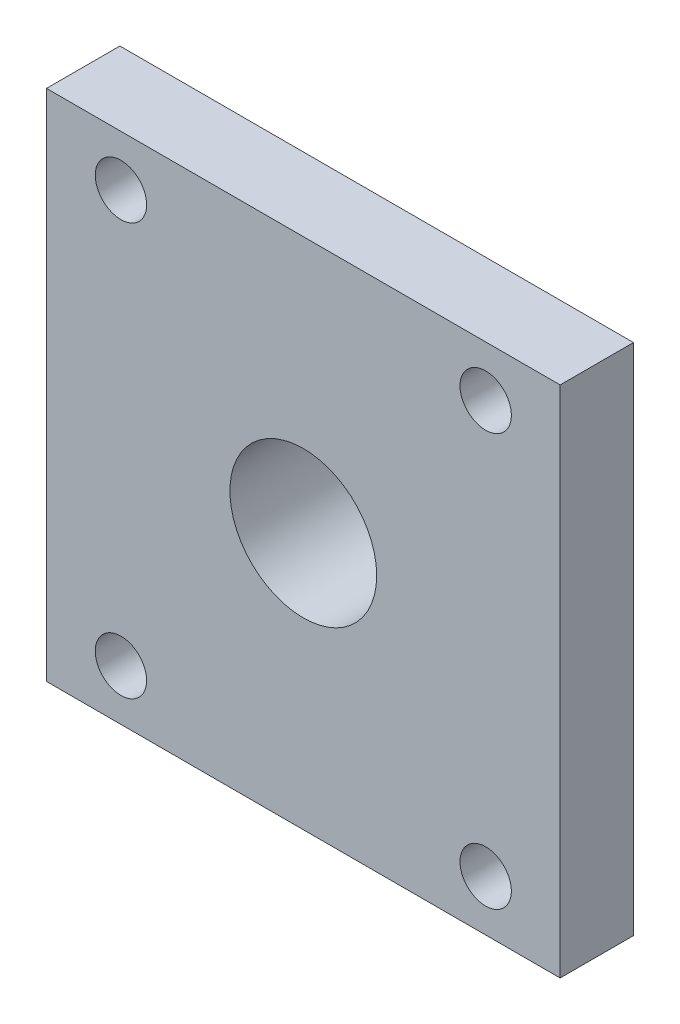
ISO-10303-21;
HEADER;
FILE_DESCRIPTION(('STEP AP214'),'2;1');
FILE_NAME('part.step','',(''),(''),'','','');
FILE_SCHEMA(('AUTOMOTIVE_DESIGN { 1 0 10303 214 1 1 1 1 }'));
ENDSEC;
DATA;
#1=APPLICATION_CONTEXT('core data for automotive mechanical design processes');
#2=APPLICATION_PROTOCOL_DEFINITION('international standard','automotive_design',2000,#1);
#3=PRODUCT_CONTEXT('',#1,'mechanical');
#4=PRODUCT('Part','Part','',(#3));
#5=PRODUCT_RELATED_PRODUCT_CATEGORY('part','',(#4));
#6=PRODUCT_DEFINITION_FORMATION('','',#4);
#7=PRODUCT_DEFINITION_CONTEXT('part definition',#1,'design');
#8=PRODUCT_DEFINITION('design','',#6,#7);
#9=PRODUCT_DEFINITION_SHAPE('','',#8);
#10=(LENGTH_UNIT() NAMED_UNIT(*) SI_UNIT(.MILLI.,.METRE.));
#11=(NAMED_UNIT(*) PLANE_ANGLE_UNIT() SI_UNIT($,.RADIAN.));
#12=(NAMED_UNIT(*) SI_UNIT($,.STERADIAN.) SOLID_ANGLE_UNIT());
#13=UNCERTAINTY_MEASURE_WITH_UNIT(LENGTH_MEASURE(1.E-05),#10,'distance_accuracy_value','');
#14=(GEOMETRIC_REPRESENTATION_CONTEXT(3) GLOBAL_UNCERTAINTY_ASSIGNED_CONTEXT((#13)) GLOBAL_UNIT_ASSIGNED_CONTEXT((#10,
#11,#12)) REPRESENTATION_CONTEXT('',''));
#15=CARTESIAN_POINT('',(0.,0.,0.));
#16=DIRECTION('',(0.,0.,1.));
#17=DIRECTION('',(1.,0.,0.));
#18=AXIS2_PLACEMENT_3D('',#15,#16,#17);
#19=CARTESIAN_POINT('',(0.,0.,0.));
#20=DIRECTION('',(0.,0.,1.));
#21=DIRECTION('',(1.,0.,0.));
#22=AXIS2_PLACEMENT_3D('',#19,#20,#21);
#23=PLANE('',#22);
#24=DIRECTION('',(0.,1.,0.));
#25=VECTOR('',#24,1.);
#26=CARTESIAN_POINT('',(35.,35.,0.));
#27=LINE('',#26,#25);
#28=CARTESIAN_POINT('',(35.,-35.,0.));
#29=VERTEX_POINT('',#28);
#30=CARTESIAN_POINT('',(35.,35.,0.));
#31=VERTEX_POINT('',#30);
#32=EDGE_CURVE('E100',#29,#31,#27,.T.);
#33=ORIENTED_EDGE('',*,*,#32,.F.);
#34=DIRECTION('',(1.,0.,0.));
#35=VECTOR('',#34,1.);
#36=CARTESIAN_POINT('',(-35.,-35.,0.));
#37=LINE('',#36,#35);
#38=CARTESIAN_POINT('',(-35.,-35.,0.));
#39=VERTEX_POINT('',#38);
#40=EDGE_CURVE('E73',#39,#29,#37,.T.);
#41=ORIENTED_EDGE('',*,*,#40,.F.);
#42=DIRECTION('',(0.,-1.,0.));
#43=VECTOR('',#42,1.);
#44=CARTESIAN_POINT('',(-35.,35.,0.));
#45=LINE('',#44,#43);
#46=CARTESIAN_POINT('',(-35.,35.,0.));
#47=VERTEX_POINT('',#46);
#48=EDGE_CURVE('E67',#47,#39,#45,.T.);
#49=ORIENTED_EDGE('',*,*,#48,.F.);
#50=DIRECTION('',(-1.,0.,0.));
#51=VECTOR('',#50,1.);
#52=CARTESIAN_POINT('',(-35.,35.,0.));
#53=LINE('',#52,#51);
#54=EDGE_CURVE('E91',#31,#47,#53,.T.);
#55=ORIENTED_EDGE('',*,*,#54,.F.);
#56=EDGE_LOOP('',(#33,#41,#49,#55));
#57=FACE_BOUND('',#56,.T.);
#58=CARTESIAN_POINT('',(24.8555920853749,28.0793436904328,0.));
#59=DIRECTION('',(0.,0.,-1.));
#60=DIRECTION('',(-1.,0.,0.));
#61=AXIS2_PLACEMENT_3D('',#58,#59,#60);
#62=CIRCLE('',#61,3.5);
#63=CARTESIAN_POINT('',(21.3555920853749,28.0793436904328,0.));
#64=VERTEX_POINT('',#63);
#65=EDGE_CURVE('E117',#64,#64,#62,.T.);
#66=ORIENTED_EDGE('',*,*,#65,.F.);
#67=EDGE_LOOP('',(#66));
#68=FACE_BOUND('',#67,.T.);
#69=CARTESIAN_POINT('',(-24.8555920853749,28.0793436904328,0.));
#70=DIRECTION('',(0.,0.,-1.));
#71=DIRECTION('',(-1.,0.,0.));
#72=AXIS2_PLACEMENT_3D('',#69,#70,#71);
#73=CIRCLE('',#72,3.5);
#74=CARTESIAN_POINT('',(-28.3555920853749,28.0793436904328,0.));
#75=VERTEX_POINT('',#74);
#76=EDGE_CURVE('E121',#75,#75,#73,.T.);
#77=ORIENTED_EDGE('',*,*,#76,.F.);
#78=EDGE_LOOP('',(#77));
#79=FACE_BOUND('',#78,.T.);
#80=CARTESIAN_POINT('',(-24.8555920853749,-28.0793436904328,0.));
#81=DIRECTION('',(0.,0.,-1.));
#82=DIRECTION('',(-1.,0.,0.));
#83=AXIS2_PLACEMENT_3D('',#80,#81,#82);
#84=CIRCLE('',#83,3.5);
#85=CARTESIAN_POINT('',(-28.3555920853749,-28.0793436904328,0.));
#86=VERTEX_POINT('',#85);
#87=EDGE_CURVE('E125',#86,#86,#84,.T.);
#88=ORIENTED_EDGE('',*,*,#87,.F.);
#89=EDGE_LOOP('',(#88));
#90=FACE_BOUND('',#89,.T.);
#91=CARTESIAN_POINT('',(24.8555920853749,-28.0793436904328,0.));
#92=DIRECTION('',(0.,0.,-1.));
#93=DIRECTION('',(-1.,0.,0.));
#94=AXIS2_PLACEMENT_3D('',#91,#92,#93);
#95=CIRCLE('',#94,3.5);
#96=CARTESIAN_POINT('',(21.3555920853749,-28.0793436904328,0.));
#97=VERTEX_POINT('',#96);
#98=EDGE_CURVE('E129',#97,#97,#95,.T.);
#99=ORIENTED_EDGE('',*,*,#98,.F.);
#100=EDGE_LOOP('',(#99));
#101=FACE_BOUND('',#100,.T.);
#102=CARTESIAN_POINT('',(0.,0.,0.));
#103=DIRECTION('',(0.,0.,1.));
#104=DIRECTION('',(1.,0.,0.));
#105=AXIS2_PLACEMENT_3D('',#102,#103,#104);
#106=CIRCLE('',#105,13.0719617858748);
#107=CARTESIAN_POINT('',(13.0719617858748,0.,0.));
#108=VERTEX_POINT('',#107);
#109=EDGE_CURVE('E11',#108,#108,#106,.F.);
#110=ORIENTED_EDGE('',*,*,#109,.F.);
#111=EDGE_LOOP('',(#110));
#112=FACE_BOUND('',#111,.T.);
#113=ADVANCED_FACE('F33',(#57,#68,#79,#90,#101,#112),#23,.F.);
#114=CARTESIAN_POINT('',(35.,35.,10.));
#115=DIRECTION('',(-1.,0.,0.));
#116=DIRECTION('',(0.,-1.,0.));
#117=AXIS2_PLACEMENT_3D('',#114,#115,#116);
#118=PLANE('',#117);
#119=ORIENTED_EDGE('',*,*,#32,.T.);
#120=DIRECTION('',(0.,0.,-1.));
#121=VECTOR('',#120,1.);
#122=CARTESIAN_POINT('',(35.,35.,10.));
#123=LINE('',#122,#121);
#124=CARTESIAN_POINT('',(35.,35.,10.));
#125=VERTEX_POINT('',#124);
#126=EDGE_CURVE('E42',#125,#31,#123,.T.);
#127=ORIENTED_EDGE('',*,*,#126,.F.);
#128=DIRECTION('',(0.,1.,0.));
#129=VECTOR('',#128,1.);
#130=CARTESIAN_POINT('',(35.,35.,10.));
#131=LINE('',#130,#129);
#132=CARTESIAN_POINT('',(35.,-35.,10.));
#133=VERTEX_POINT('',#132);
#134=EDGE_CURVE('E86',#133,#125,#131,.T.);
#135=ORIENTED_EDGE('',*,*,#134,.F.);
#136=DIRECTION('',(0.,0.,-1.));
#137=VECTOR('',#136,1.);
#138=CARTESIAN_POINT('',(35.,-35.,10.));
#139=LINE('',#138,#137);
#140=EDGE_CURVE('E96',#133,#29,#139,.T.);
#141=ORIENTED_EDGE('',*,*,#140,.T.);
#142=EDGE_LOOP('',(#119,#127,#135,#141));
#143=FACE_BOUND('',#142,.T.);
#144=ADVANCED_FACE('F35',(#143),#118,.F.);
#145=CARTESIAN_POINT('',(-35.,35.,10.));
#146=DIRECTION('',(0.,-1.,0.));
#147=DIRECTION('',(0.,0.,-1.));
#148=AXIS2_PLACEMENT_3D('',#145,#146,#147);
#149=PLANE('',#148);
#150=ORIENTED_EDGE('',*,*,#54,.T.);
#151=DIRECTION('',(0.,0.,-1.));
#152=VECTOR('',#151,1.);
#153=CARTESIAN_POINT('',(-35.,35.,10.));
#154=LINE('',#153,#152);
#155=CARTESIAN_POINT('',(-35.,35.,10.));
#156=VERTEX_POINT('',#155);
#157=EDGE_CURVE('E89',#156,#47,#154,.T.);
#158=ORIENTED_EDGE('',*,*,#157,.F.);
#159=DIRECTION('',(-1.,0.,0.));
#160=VECTOR('',#159,1.);
#161=CARTESIAN_POINT('',(-35.,35.,10.));
#162=LINE('',#161,#160);
#163=EDGE_CURVE('E81',#125,#156,#162,.T.);
#164=ORIENTED_EDGE('',*,*,#163,.F.);
#165=ORIENTED_EDGE('',*,*,#126,.T.);
#166=EDGE_LOOP('',(#150,#158,#164,#165));
#167=FACE_BOUND('',#166,.T.);
#168=ADVANCED_FACE('F90',(#167),#149,.F.);
#169=CARTESIAN_POINT('',(-35.,35.,10.));
#170=DIRECTION('',(1.,0.,0.));
#171=DIRECTION('',(0.,0.,-1.));
#172=AXIS2_PLACEMENT_3D('',#169,#170,#171);
#173=PLANE('',#172);
#174=ORIENTED_EDGE('',*,*,#48,.T.);
#175=DIRECTION('',(0.,0.,-1.));
#176=VECTOR('',#175,1.);
#177=CARTESIAN_POINT('',(-35.,-35.,10.));
#178=LINE('',#177,#176);
#179=CARTESIAN_POINT('',(-35.,-35.,10.));
#180=VERTEX_POINT('',#179);
#181=EDGE_CURVE('E92',#180,#39,#178,.T.);
#182=ORIENTED_EDGE('',*,*,#181,.F.);
#183=DIRECTION('',(0.,-1.,0.));
#184=VECTOR('',#183,1.);
#185=CARTESIAN_POINT('',(-35.,35.,10.));
#186=LINE('',#185,#184);
#187=EDGE_CURVE('E84',#156,#180,#186,.T.);
#188=ORIENTED_EDGE('',*,*,#187,.F.);
#189=ORIENTED_EDGE('',*,*,#157,.T.);
#190=EDGE_LOOP('',(#174,#182,#188,#189));
#191=FACE_BOUND('',#190,.T.);
#192=ADVANCED_FACE('F94',(#191),#173,.F.);
#193=CARTESIAN_POINT('',(-35.,-35.,10.));
#194=DIRECTION('',(0.,1.,0.));
#195=DIRECTION('',(0.,0.,1.));
#196=AXIS2_PLACEMENT_3D('',#193,#194,#195);
#197=PLANE('',#196);
#198=ORIENTED_EDGE('',*,*,#40,.T.);
#199=ORIENTED_EDGE('',*,*,#140,.F.);
#200=DIRECTION('',(1.,0.,0.));
#201=VECTOR('',#200,1.);
#202=CARTESIAN_POINT('',(-35.,-35.,10.));
#203=LINE('',#202,#201);
#204=EDGE_CURVE('E50',#180,#133,#203,.T.);
#205=ORIENTED_EDGE('',*,*,#204,.F.);
#206=ORIENTED_EDGE('',*,*,#181,.T.);
#207=EDGE_LOOP('',(#198,#199,#205,#206));
#208=FACE_BOUND('',#207,.T.);
#209=ADVANCED_FACE('F165',(#208),#197,.F.);
#210=CARTESIAN_POINT('',(0.,0.,10.));
#211=DIRECTION('',(0.,0.,1.));
#212=DIRECTION('',(1.,0.,0.));
#213=AXIS2_PLACEMENT_3D('',#210,#211,#212);
#214=PLANE('',#213);
#215=CARTESIAN_POINT('',(24.8555920853749,-28.0793436904328,10.));
#216=DIRECTION('',(0.,0.,1.));
#217=DIRECTION('',(1.,0.,0.));
#218=AXIS2_PLACEMENT_3D('',#215,#216,#217);
#219=CIRCLE('',#218,3.5);
#220=CARTESIAN_POINT('',(28.3555920853749,-28.0793436904328,10.));
#221=VERTEX_POINT('',#220);
#222=EDGE_CURVE('E255',#221,#221,#219,.T.);
#223=ORIENTED_EDGE('',*,*,#222,.F.);
#224=EDGE_LOOP('',(#223));
#225=FACE_BOUND('',#224,.T.);
#226=CARTESIAN_POINT('',(-24.8555920853749,-28.0793436904328,10.));
#227=DIRECTION('',(0.,0.,1.));
#228=DIRECTION('',(1.,0.,0.));
#229=AXIS2_PLACEMENT_3D('',#226,#227,#228);
#230=CIRCLE('',#229,3.5);
#231=CARTESIAN_POINT('',(-21.3555920853749,-28.0793436904328,10.));
#232=VERTEX_POINT('',#231);
#233=EDGE_CURVE('E259',#232,#232,#230,.T.);
#234=ORIENTED_EDGE('',*,*,#233,.F.);
#235=EDGE_LOOP('',(#234));
#236=FACE_BOUND('',#235,.T.);
#237=CARTESIAN_POINT('',(-24.8555920853749,28.0793436904328,10.));
#238=DIRECTION('',(0.,0.,1.));
#239=DIRECTION('',(1.,0.,0.));
#240=AXIS2_PLACEMENT_3D('',#237,#238,#239);
#241=CIRCLE('',#240,3.5);
#242=CARTESIAN_POINT('',(-21.3555920853749,28.0793436904328,10.));
#243=VERTEX_POINT('',#242);
#244=EDGE_CURVE('E263',#243,#243,#241,.T.);
#245=ORIENTED_EDGE('',*,*,#244,.F.);
#246=EDGE_LOOP('',(#245));
#247=FACE_BOUND('',#246,.T.);
#248=CARTESIAN_POINT('',(24.8555920853749,28.0793436904328,10.));
#249=DIRECTION('',(0.,0.,1.));
#250=DIRECTION('',(1.,0.,0.));
#251=AXIS2_PLACEMENT_3D('',#248,#249,#250);
#252=CIRCLE('',#251,3.5);
#253=CARTESIAN_POINT('',(28.3555920853749,28.0793436904328,10.));
#254=VERTEX_POINT('',#253);
#255=EDGE_CURVE('E267',#254,#254,#252,.T.);
#256=ORIENTED_EDGE('',*,*,#255,.F.);
#257=EDGE_LOOP('',(#256));
#258=FACE_BOUND('',#257,.T.);
#259=CARTESIAN_POINT('',(0.,0.,10.));
#260=DIRECTION('',(0.,0.,1.));
#261=DIRECTION('',(1.,0.,0.));
#262=AXIS2_PLACEMENT_3D('',#259,#260,#261);
#263=CIRCLE('',#262,10.);
#264=CARTESIAN_POINT('',(10.,0.,10.));
#265=VERTEX_POINT('',#264);
#266=EDGE_CURVE('E103',#265,#265,#263,.T.);
#267=ORIENTED_EDGE('',*,*,#266,.F.);
#268=EDGE_LOOP('',(#267));
#269=FACE_BOUND('',#268,.T.);
#270=ORIENTED_EDGE('',*,*,#134,.T.);
#271=ORIENTED_EDGE('',*,*,#163,.T.);
#272=ORIENTED_EDGE('',*,*,#187,.T.);
#273=ORIENTED_EDGE('',*,*,#204,.T.);
#274=EDGE_LOOP('',(#270,#271,#272,#273));
#275=FACE_BOUND('',#274,.T.);
#276=ADVANCED_FACE('F82',(#225,#236,#247,#258,#269,#275),#214,.T.);
#277=CARTESIAN_POINT('',(0.,0.,0.));
#278=DIRECTION('',(0.,0.,1.));
#279=DIRECTION('',(1.,0.,0.));
#280=AXIS2_PLACEMENT_3D('',#277,#278,#279);
#281=CYLINDRICAL_SURFACE('',#280,10.);
#282=ORIENTED_EDGE('',*,*,#266,.T.);
#283=EDGE_LOOP('',(#282));
#284=FACE_BOUND('',#283,.T.);
#285=CARTESIAN_POINT('',(0.,0.,-15.));
#286=DIRECTION('',(0.,0.,-1.));
#287=DIRECTION('',(-1.,0.,0.));
#288=AXIS2_PLACEMENT_3D('',#285,#286,#287);
#289=CIRCLE('',#288,10.);
#290=CARTESIAN_POINT('',(-10.,0.,-15.));
#291=VERTEX_POINT('',#290);
#292=EDGE_CURVE('E283',#291,#291,#289,.T.);
#293=ORIENTED_EDGE('',*,*,#292,.T.);
#294=EDGE_LOOP('',(#293));
#295=FACE_BOUND('',#294,.T.);
#296=ADVANCED_FACE('F159',(#284,#295),#281,.F.);
#297=CARTESIAN_POINT('',(24.8555920853749,28.0793436904328,35.));
#298=DIRECTION('',(0.,0.,-1.));
#299=DIRECTION('',(-1.,0.,0.));
#300=AXIS2_PLACEMENT_3D('',#297,#298,#299);
#301=CYLINDRICAL_SURFACE('',#300,3.5);
#302=ORIENTED_EDGE('',*,*,#255,.T.);
#303=EDGE_LOOP('',(#302));
#304=FACE_BOUND('',#303,.T.);
#305=ORIENTED_EDGE('',*,*,#65,.T.);
#306=EDGE_LOOP('',(#305));
#307=FACE_BOUND('',#306,.T.);
#308=ADVANCED_FACE('F149',(#304,#307),#301,.F.);
#309=CARTESIAN_POINT('',(-24.8555920853749,28.0793436904328,35.));
#310=DIRECTION('',(0.,0.,-1.));
#311=DIRECTION('',(-1.,0.,0.));
#312=AXIS2_PLACEMENT_3D('',#309,#310,#311);
#313=CYLINDRICAL_SURFACE('',#312,3.5);
#314=ORIENTED_EDGE('',*,*,#244,.T.);
#315=EDGE_LOOP('',(#314));
#316=FACE_BOUND('',#315,.T.);
#317=ORIENTED_EDGE('',*,*,#76,.T.);
#318=EDGE_LOOP('',(#317));
#319=FACE_BOUND('',#318,.T.);
#320=ADVANCED_FACE('F145',(#316,#319),#313,.F.);
#321=CARTESIAN_POINT('',(-24.8555920853749,-28.0793436904328,35.));
#322=DIRECTION('',(0.,0.,-1.));
#323=DIRECTION('',(-1.,0.,0.));
#324=AXIS2_PLACEMENT_3D('',#321,#322,#323);
#325=CYLINDRICAL_SURFACE('',#324,3.5);
#326=ORIENTED_EDGE('',*,*,#233,.T.);
#327=EDGE_LOOP('',(#326));
#328=FACE_BOUND('',#327,.T.);
#329=ORIENTED_EDGE('',*,*,#87,.T.);
#330=EDGE_LOOP('',(#329));
#331=FACE_BOUND('',#330,.T.);
#332=ADVANCED_FACE('F148',(#328,#331),#325,.F.);
#333=CARTESIAN_POINT('',(24.8555920853749,-28.0793436904328,35.));
#334=DIRECTION('',(0.,0.,-1.));
#335=DIRECTION('',(-1.,0.,0.));
#336=AXIS2_PLACEMENT_3D('',#333,#334,#335);
#337=CYLINDRICAL_SURFACE('',#336,3.5);
#338=ORIENTED_EDGE('',*,*,#222,.T.);
#339=EDGE_LOOP('',(#338));
#340=FACE_BOUND('',#339,.T.);
#341=ORIENTED_EDGE('',*,*,#98,.T.);
#342=EDGE_LOOP('',(#341));
#343=FACE_BOUND('',#342,.T.);
#344=ADVANCED_FACE('F140',(#340,#343),#337,.F.);
#345=CARTESIAN_POINT('',(0.,0.,-15.));
#346=DIRECTION('',(0.,0.,-1.));
#347=DIRECTION('',(-1.,0.,0.));
#348=AXIS2_PLACEMENT_3D('',#345,#346,#347);
#349=PLANE('',#348);
#350=CARTESIAN_POINT('',(0.,0.,-15.));
#351=DIRECTION('',(0.,0.,-1.));
#352=DIRECTION('',(-1.,0.,0.));
#353=AXIS2_PLACEMENT_3D('',#350,#351,#352);
#354=CIRCLE('',#353,13.0719617858748);
#355=CARTESIAN_POINT('',(-13.0719617858748,0.,-15.));
#356=VERTEX_POINT('',#355);
#357=EDGE_CURVE('E278',#356,#356,#354,.T.);
#358=ORIENTED_EDGE('',*,*,#357,.T.);
#359=EDGE_LOOP('',(#358));
#360=FACE_BOUND('',#359,.T.);
#361=ORIENTED_EDGE('',*,*,#292,.F.);
#362=EDGE_LOOP('',(#361));
#363=FACE_BOUND('',#362,.T.);
#364=ADVANCED_FACE('F134',(#360,#363),#349,.T.);
#365=CARTESIAN_POINT('',(0.,0.,-15.));
#366=DIRECTION('',(0.,0.,1.));
#367=DIRECTION('',(1.,0.,0.));
#368=AXIS2_PLACEMENT_3D('',#365,#366,#367);
#369=CYLINDRICAL_SURFACE('',#368,13.0719617858748);
#370=ORIENTED_EDGE('',*,*,#357,.F.);
#371=EDGE_LOOP('',(#370));
#372=FACE_BOUND('',#371,.T.);
#373=ORIENTED_EDGE('',*,*,#109,.T.);
#374=EDGE_LOOP('',(#373));
#375=FACE_BOUND('',#374,.T.);
#376=ADVANCED_FACE('F132',(#372,#375),#369,.T.);
#377=CLOSED_SHELL('',(#113,#144,#168,#192,#209,#276,#296,#308,#320,#332,#344,#364,#376));
#378=MANIFOLD_SOLID_BREP('B2',#377);
#379=ADVANCED_BREP_SHAPE_REPRESENTATION('',(#18,#378),#14);
#380=SHAPE_DEFINITION_REPRESENTATION(#9,#379);
ENDSEC;
END-ISO-10303-21;
